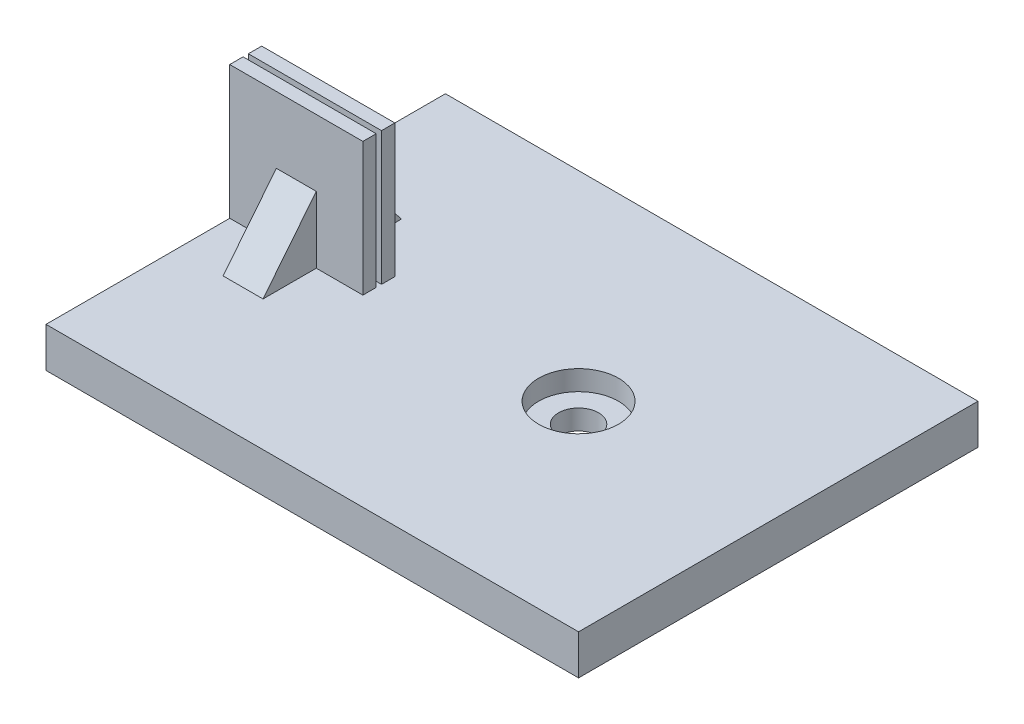
ISO-10303-21;
HEADER;
FILE_DESCRIPTION(('STEP AP214'),'2;1');
FILE_NAME('part.step','',(''),(''),'','','');
FILE_SCHEMA(('AUTOMOTIVE_DESIGN { 1 0 10303 214 1 1 1 1 }'));
ENDSEC;
DATA;
#1=APPLICATION_CONTEXT('core data for automotive mechanical design processes');
#2=APPLICATION_PROTOCOL_DEFINITION('international standard','automotive_design',2000,#1);
#3=PRODUCT_CONTEXT('',#1,'mechanical');
#4=PRODUCT('Part','Part','',(#3));
#5=PRODUCT_RELATED_PRODUCT_CATEGORY('part','',(#4));
#6=PRODUCT_DEFINITION_FORMATION('','',#4);
#7=PRODUCT_DEFINITION_CONTEXT('part definition',#1,'design');
#8=PRODUCT_DEFINITION('design','',#6,#7);
#9=PRODUCT_DEFINITION_SHAPE('','',#8);
#10=(LENGTH_UNIT() NAMED_UNIT(*) SI_UNIT(.MILLI.,.METRE.));
#11=(NAMED_UNIT(*) PLANE_ANGLE_UNIT() SI_UNIT($,.RADIAN.));
#12=(NAMED_UNIT(*) SI_UNIT($,.STERADIAN.) SOLID_ANGLE_UNIT());
#13=UNCERTAINTY_MEASURE_WITH_UNIT(LENGTH_MEASURE(1.E-05),#10,'distance_accuracy_value','');
#14=(GEOMETRIC_REPRESENTATION_CONTEXT(3) GLOBAL_UNCERTAINTY_ASSIGNED_CONTEXT((#13)) GLOBAL_UNIT_ASSIGNED_CONTEXT((#10,
#11,#12)) REPRESENTATION_CONTEXT('',''));
#15=CARTESIAN_POINT('',(0.,0.,0.));
#16=DIRECTION('',(0.,0.,1.));
#17=DIRECTION('',(1.,0.,0.));
#18=AXIS2_PLACEMENT_3D('',#15,#16,#17);
#19=CARTESIAN_POINT('',(0.,3.,0.));
#20=DIRECTION('',(0.,1.,0.));
#21=DIRECTION('',(0.,0.,1.));
#22=AXIS2_PLACEMENT_3D('',#19,#20,#21);
#23=PLANE('',#22);
#24=DIRECTION('',(0.,0.,-1.));
#25=VECTOR('',#24,1.);
#26=CARTESIAN_POINT('',(-18.5,3.,0.));
#27=LINE('',#26,#25);
#28=CARTESIAN_POINT('',(-18.5,3.,5.2));
#29=VERTEX_POINT('',#28);
#30=CARTESIAN_POINT('',(-18.5,3.,1.2));
#31=VERTEX_POINT('',#30);
#32=EDGE_CURVE('E193',#29,#31,#27,.T.);
#33=ORIENTED_EDGE('',*,*,#32,.F.);
#34=DIRECTION('',(1.,0.,0.));
#35=VECTOR('',#34,1.);
#36=CARTESIAN_POINT('',(0.,3.,5.2));
#37=LINE('',#36,#35);
#38=CARTESIAN_POINT('',(-21.5,3.,5.2));
#39=VERTEX_POINT('',#38);
#40=EDGE_CURVE('E200',#39,#29,#37,.T.);
#41=ORIENTED_EDGE('',*,*,#40,.F.);
#42=DIRECTION('',(0.,0.,-1.));
#43=VECTOR('',#42,1.);
#44=CARTESIAN_POINT('',(-21.5,3.,0.));
#45=LINE('',#44,#43);
#46=CARTESIAN_POINT('',(-21.5,3.,1.2));
#47=VERTEX_POINT('',#46);
#48=EDGE_CURVE('E187',#39,#47,#45,.T.);
#49=ORIENTED_EDGE('',*,*,#48,.T.);
#50=DIRECTION('',(1.,0.,0.));
#51=VECTOR('',#50,1.);
#52=CARTESIAN_POINT('',(-25.,3.,1.2));
#53=LINE('',#52,#51);
#54=CARTESIAN_POINT('',(-25.,3.,1.2));
#55=VERTEX_POINT('',#54);
#56=EDGE_CURVE('E242',#55,#47,#53,.T.);
#57=ORIENTED_EDGE('',*,*,#56,.F.);
#58=DIRECTION('',(0.,0.,1.));
#59=VECTOR('',#58,1.);
#60=CARTESIAN_POINT('',(-25.,3.,-15.));
#61=LINE('',#60,#59);
#62=CARTESIAN_POINT('',(-25.,3.,15.));
#63=VERTEX_POINT('',#62);
#64=EDGE_CURVE('E289',#55,#63,#61,.T.);
#65=ORIENTED_EDGE('',*,*,#64,.T.);
#66=DIRECTION('',(1.,0.,0.));
#67=VECTOR('',#66,1.);
#68=CARTESIAN_POINT('',(-25.,3.,15.));
#69=LINE('',#68,#67);
#70=CARTESIAN_POINT('',(15.,3.,15.));
#71=VERTEX_POINT('',#70);
#72=EDGE_CURVE('E287',#63,#71,#69,.T.);
#73=ORIENTED_EDGE('',*,*,#72,.T.);
#74=DIRECTION('',(0.,0.,-1.));
#75=VECTOR('',#74,1.);
#76=CARTESIAN_POINT('',(15.,3.,-15.));
#77=LINE('',#76,#75);
#78=CARTESIAN_POINT('',(15.,3.,-15.));
#79=VERTEX_POINT('',#78);
#80=EDGE_CURVE('E291',#71,#79,#77,.T.);
#81=ORIENTED_EDGE('',*,*,#80,.T.);
#82=DIRECTION('',(-1.,0.,0.));
#83=VECTOR('',#82,1.);
#84=CARTESIAN_POINT('',(-25.,3.,-15.));
#85=LINE('',#84,#83);
#86=CARTESIAN_POINT('',(-25.,3.,-15.));
#87=VERTEX_POINT('',#86);
#88=EDGE_CURVE('E293',#79,#87,#85,.T.);
#89=ORIENTED_EDGE('',*,*,#88,.T.);
#90=CARTESIAN_POINT('',(-25.,3.,-1.2));
#91=VERTEX_POINT('',#90);
#92=EDGE_CURVE('E284',#87,#91,#61,.T.);
#93=ORIENTED_EDGE('',*,*,#92,.T.);
#94=DIRECTION('',(-1.,0.,0.));
#95=VECTOR('',#94,1.);
#96=CARTESIAN_POINT('',(-25.,3.,-1.2));
#97=LINE('',#96,#95);
#98=CARTESIAN_POINT('',(-21.5,3.,-1.2));
#99=VERTEX_POINT('',#98);
#100=EDGE_CURVE('E219',#99,#91,#97,.T.);
#101=ORIENTED_EDGE('',*,*,#100,.F.);
#102=DIRECTION('',(0.,0.,-1.));
#103=VECTOR('',#102,1.);
#104=CARTESIAN_POINT('',(-21.5,3.,0.));
#105=LINE('',#104,#103);
#106=CARTESIAN_POINT('',(-21.5,3.,-5.2));
#107=VERTEX_POINT('',#106);
#108=EDGE_CURVE('E53',#99,#107,#105,.T.);
#109=ORIENTED_EDGE('',*,*,#108,.T.);
#110=DIRECTION('',(1.,0.,0.));
#111=VECTOR('',#110,1.);
#112=CARTESIAN_POINT('',(0.,3.,-5.2));
#113=LINE('',#112,#111);
#114=CARTESIAN_POINT('',(-18.5,3.,-5.2));
#115=VERTEX_POINT('',#114);
#116=EDGE_CURVE('E48',#115,#107,#113,.F.);
#117=ORIENTED_EDGE('',*,*,#116,.F.);
#118=DIRECTION('',(0.,0.,-1.));
#119=VECTOR('',#118,1.);
#120=CARTESIAN_POINT('',(-18.5,3.,0.));
#121=LINE('',#120,#119);
#122=CARTESIAN_POINT('',(-18.5,3.,-1.2));
#123=VERTEX_POINT('',#122);
#124=EDGE_CURVE('E177',#123,#115,#121,.T.);
#125=ORIENTED_EDGE('',*,*,#124,.F.);
#126=CARTESIAN_POINT('',(-15.,3.,-1.20000000000001));
#127=VERTEX_POINT('',#126);
#128=EDGE_CURVE('E208',#127,#123,#97,.T.);
#129=ORIENTED_EDGE('',*,*,#128,.F.);
#130=DIRECTION('',(0.,0.,-1.));
#131=VECTOR('',#130,1.);
#132=CARTESIAN_POINT('',(-15.,3.,-0.200000000000005));
#133=LINE('',#132,#131);
#134=CARTESIAN_POINT('',(-15.,3.,-0.200000000000005));
#135=VERTEX_POINT('',#134);
#136=EDGE_CURVE('E216',#135,#127,#133,.T.);
#137=ORIENTED_EDGE('',*,*,#136,.F.);
#138=DIRECTION('',(1.,0.,0.));
#139=VECTOR('',#138,1.);
#140=CARTESIAN_POINT('',(-25.,3.,-0.199999999999999));
#141=LINE('',#140,#139);
#142=CARTESIAN_POINT('',(-25.,3.,-0.199999999999999));
#143=VERTEX_POINT('',#142);
#144=EDGE_CURVE('E203',#143,#135,#141,.T.);
#145=ORIENTED_EDGE('',*,*,#144,.F.);
#146=CARTESIAN_POINT('',(-25.,3.,0.200000000000002));
#147=VERTEX_POINT('',#146);
#148=EDGE_CURVE('E288',#143,#147,#61,.T.);
#149=ORIENTED_EDGE('',*,*,#148,.T.);
#150=DIRECTION('',(-1.,0.,0.));
#151=VECTOR('',#150,1.);
#152=CARTESIAN_POINT('',(-25.,3.,0.200000000000002));
#153=LINE('',#152,#151);
#154=CARTESIAN_POINT('',(-15.,3.,0.200000000000002));
#155=VERTEX_POINT('',#154);
#156=EDGE_CURVE('E235',#155,#147,#153,.T.);
#157=ORIENTED_EDGE('',*,*,#156,.F.);
#158=DIRECTION('',(0.,0.,-1.));
#159=VECTOR('',#158,1.);
#160=CARTESIAN_POINT('',(-15.,3.,1.2));
#161=LINE('',#160,#159);
#162=CARTESIAN_POINT('',(-15.,3.,1.2));
#163=VERTEX_POINT('',#162);
#164=EDGE_CURVE('E244',#163,#155,#161,.T.);
#165=ORIENTED_EDGE('',*,*,#164,.F.);
#166=EDGE_CURVE('E230',#31,#163,#53,.T.);
#167=ORIENTED_EDGE('',*,*,#166,.F.);
#168=EDGE_LOOP('',(#33,#41,#49,#57,#65,#73,#81,#89,#93,#101,#109,#117,#125,#129,#137,#145,#149,
#157,#165,#167));
#169=FACE_BOUND('',#168,.T.);
#170=CARTESIAN_POINT('',(0.,3.,0.));
#171=DIRECTION('',(0.,1.,0.));
#172=DIRECTION('',(0.,0.,1.));
#173=AXIS2_PLACEMENT_3D('',#170,#171,#172);
#174=CIRCLE('',#173,3.);
#175=CARTESIAN_POINT('',(0.,3.,3.));
#176=VERTEX_POINT('',#175);
#177=EDGE_CURVE('E275',#176,#176,#174,.T.);
#178=ORIENTED_EDGE('',*,*,#177,.F.);
#179=EDGE_LOOP('',(#178));
#180=FACE_BOUND('',#179,.T.);
#181=ADVANCED_FACE('F33',(#169,#180),#23,.T.);
#182=CARTESIAN_POINT('',(0.,0.,0.));
#183=DIRECTION('',(0.,1.,0.));
#184=DIRECTION('',(0.,0.,1.));
#185=AXIS2_PLACEMENT_3D('',#182,#183,#184);
#186=PLANE('',#185);
#187=CARTESIAN_POINT('',(0.,0.,0.));
#188=DIRECTION('',(0.,1.,0.));
#189=DIRECTION('',(0.,0.,1.));
#190=AXIS2_PLACEMENT_3D('',#187,#188,#189);
#191=CIRCLE('',#190,1.5);
#192=CARTESIAN_POINT('',(0.,0.,1.5));
#193=VERTEX_POINT('',#192);
#194=EDGE_CURVE('E272',#193,#193,#191,.T.);
#195=ORIENTED_EDGE('',*,*,#194,.T.);
#196=EDGE_LOOP('',(#195));
#197=FACE_BOUND('',#196,.T.);
#198=CARTESIAN_POINT('',(0.,0.,0.));
#199=DIRECTION('',(0.,-1.,0.));
#200=DIRECTION('',(0.,0.,-1.));
#201=AXIS2_PLACEMENT_3D('',#198,#199,#200);
#202=CIRCLE('',#201,3.);
#203=CARTESIAN_POINT('',(0.,0.,-3.));
#204=VERTEX_POINT('',#203);
#205=EDGE_CURVE('E259',#204,#204,#202,.T.);
#206=ORIENTED_EDGE('',*,*,#205,.T.);
#207=EDGE_LOOP('',(#206));
#208=FACE_BOUND('',#207,.T.);
#209=ADVANCED_FACE('F379',(#197,#208),#186,.F.);
#210=CARTESIAN_POINT('',(-25.,3.,-15.));
#211=DIRECTION('',(1.,0.,0.));
#212=DIRECTION('',(0.,0.,-1.));
#213=AXIS2_PLACEMENT_3D('',#210,#211,#212);
#214=PLANE('',#213);
#215=DIRECTION('',(0.,0.,1.));
#216=VECTOR('',#215,1.);
#217=CARTESIAN_POINT('',(-25.,0.,-15.));
#218=LINE('',#217,#216);
#219=CARTESIAN_POINT('',(-25.,0.,-15.));
#220=VERTEX_POINT('',#219);
#221=CARTESIAN_POINT('',(-25.,0.,15.));
#222=VERTEX_POINT('',#221);
#223=EDGE_CURVE('E281',#220,#222,#218,.T.);
#224=ORIENTED_EDGE('',*,*,#223,.T.);
#225=DIRECTION('',(0.,-1.,0.));
#226=VECTOR('',#225,1.);
#227=CARTESIAN_POINT('',(-25.,3.,15.));
#228=LINE('',#227,#226);
#229=EDGE_CURVE('E41',#63,#222,#228,.T.);
#230=ORIENTED_EDGE('',*,*,#229,.F.);
#231=ORIENTED_EDGE('',*,*,#64,.F.);
#232=DIRECTION('',(0.,-1.,0.));
#233=VECTOR('',#232,1.);
#234=CARTESIAN_POINT('',(-25.,13.,1.2));
#235=LINE('',#234,#233);
#236=CARTESIAN_POINT('',(-25.,13.,1.2));
#237=VERTEX_POINT('',#236);
#238=EDGE_CURVE('E256',#237,#55,#235,.T.);
#239=ORIENTED_EDGE('',*,*,#238,.F.);
#240=DIRECTION('',(0.,0.,1.));
#241=VECTOR('',#240,1.);
#242=CARTESIAN_POINT('',(-25.,13.,1.2));
#243=LINE('',#242,#241);
#244=CARTESIAN_POINT('',(-25.,13.,0.200000000000002));
#245=VERTEX_POINT('',#244);
#246=EDGE_CURVE('E231',#245,#237,#243,.T.);
#247=ORIENTED_EDGE('',*,*,#246,.F.);
#248=DIRECTION('',(0.,-1.,0.));
#249=VECTOR('',#248,1.);
#250=CARTESIAN_POINT('',(-25.,13.,0.200000000000002));
#251=LINE('',#250,#249);
#252=EDGE_CURVE('E241',#245,#147,#251,.T.);
#253=ORIENTED_EDGE('',*,*,#252,.T.);
#254=ORIENTED_EDGE('',*,*,#148,.F.);
#255=DIRECTION('',(0.,-1.,0.));
#256=VECTOR('',#255,1.);
#257=CARTESIAN_POINT('',(-25.,13.,-0.199999999999999));
#258=LINE('',#257,#256);
#259=CARTESIAN_POINT('',(-25.,13.,-0.199999999999999));
#260=VERTEX_POINT('',#259);
#261=EDGE_CURVE('E228',#260,#143,#258,.T.);
#262=ORIENTED_EDGE('',*,*,#261,.F.);
#263=DIRECTION('',(0.,0.,1.));
#264=VECTOR('',#263,1.);
#265=CARTESIAN_POINT('',(-25.,13.,-0.199999999999999));
#266=LINE('',#265,#264);
#267=CARTESIAN_POINT('',(-25.,13.,-1.2));
#268=VERTEX_POINT('',#267);
#269=EDGE_CURVE('E204',#268,#260,#266,.T.);
#270=ORIENTED_EDGE('',*,*,#269,.F.);
#271=DIRECTION('',(0.,-1.,0.));
#272=VECTOR('',#271,1.);
#273=CARTESIAN_POINT('',(-25.,13.,-1.2));
#274=LINE('',#273,#272);
#275=EDGE_CURVE('E214',#268,#91,#274,.T.);
#276=ORIENTED_EDGE('',*,*,#275,.T.);
#277=ORIENTED_EDGE('',*,*,#92,.F.);
#278=DIRECTION('',(0.,-1.,0.));
#279=VECTOR('',#278,1.);
#280=CARTESIAN_POINT('',(-25.,3.,-15.));
#281=LINE('',#280,#279);
#282=EDGE_CURVE('E295',#87,#220,#281,.T.);
#283=ORIENTED_EDGE('',*,*,#282,.T.);
#284=EDGE_LOOP('',(#224,#230,#231,#239,#247,#253,#254,#262,#270,#276,#277,#283));
#285=FACE_BOUND('',#284,.T.);
#286=ADVANCED_FACE('F35',(#285),#214,.F.);
#287=CARTESIAN_POINT('',(-25.,3.,15.));
#288=DIRECTION('',(0.,0.,-1.));
#289=DIRECTION('',(-1.,0.,0.));
#290=AXIS2_PLACEMENT_3D('',#287,#288,#289);
#291=PLANE('',#290);
#292=DIRECTION('',(0.,-1.,0.));
#293=VECTOR('',#292,1.);
#294=CARTESIAN_POINT('',(15.,3.,15.));
#295=LINE('',#294,#293);
#296=CARTESIAN_POINT('',(15.,0.,15.));
#297=VERTEX_POINT('',#296);
#298=EDGE_CURVE('E309',#71,#297,#295,.T.);
#299=ORIENTED_EDGE('',*,*,#298,.F.);
#300=ORIENTED_EDGE('',*,*,#72,.F.);
#301=ORIENTED_EDGE('',*,*,#229,.T.);
#302=DIRECTION('',(1.,0.,0.));
#303=VECTOR('',#302,1.);
#304=CARTESIAN_POINT('',(-25.,0.,15.));
#305=LINE('',#304,#303);
#306=EDGE_CURVE('E298',#222,#297,#305,.T.);
#307=ORIENTED_EDGE('',*,*,#306,.T.);
#308=EDGE_LOOP('',(#299,#300,#301,#307));
#309=FACE_BOUND('',#308,.T.);
#310=ADVANCED_FACE('F316',(#309),#291,.F.);
#311=CARTESIAN_POINT('',(15.,3.,-15.));
#312=DIRECTION('',(-1.,0.,0.));
#313=DIRECTION('',(0.,0.,1.));
#314=AXIS2_PLACEMENT_3D('',#311,#312,#313);
#315=PLANE('',#314);
#316=DIRECTION('',(0.,0.,-1.));
#317=VECTOR('',#316,1.);
#318=CARTESIAN_POINT('',(15.,0.,-15.));
#319=LINE('',#318,#317);
#320=CARTESIAN_POINT('',(15.,0.,-15.));
#321=VERTEX_POINT('',#320);
#322=EDGE_CURVE('E300',#297,#321,#319,.T.);
#323=ORIENTED_EDGE('',*,*,#322,.T.);
#324=DIRECTION('',(0.,-1.,0.));
#325=VECTOR('',#324,1.);
#326=CARTESIAN_POINT('',(15.,3.,-15.));
#327=LINE('',#326,#325);
#328=EDGE_CURVE('E306',#79,#321,#327,.T.);
#329=ORIENTED_EDGE('',*,*,#328,.F.);
#330=ORIENTED_EDGE('',*,*,#80,.F.);
#331=ORIENTED_EDGE('',*,*,#298,.T.);
#332=EDGE_LOOP('',(#323,#329,#330,#331));
#333=FACE_BOUND('',#332,.T.);
#334=ADVANCED_FACE('F329',(#333),#315,.F.);
#335=CARTESIAN_POINT('',(-25.,3.,-15.));
#336=DIRECTION('',(0.,0.,1.));
#337=DIRECTION('',(1.,0.,0.));
#338=AXIS2_PLACEMENT_3D('',#335,#336,#337);
#339=PLANE('',#338);
#340=DIRECTION('',(-1.,0.,0.));
#341=VECTOR('',#340,1.);
#342=CARTESIAN_POINT('',(-25.,0.,-15.));
#343=LINE('',#342,#341);
#344=EDGE_CURVE('E302',#321,#220,#343,.T.);
#345=ORIENTED_EDGE('',*,*,#344,.T.);
#346=ORIENTED_EDGE('',*,*,#282,.F.);
#347=ORIENTED_EDGE('',*,*,#88,.F.);
#348=ORIENTED_EDGE('',*,*,#328,.T.);
#349=EDGE_LOOP('',(#345,#346,#347,#348));
#350=FACE_BOUND('',#349,.T.);
#351=ADVANCED_FACE('F333',(#350),#339,.F.);
#352=ORIENTED_EDGE('',*,*,#322,.F.);
#353=ORIENTED_EDGE('',*,*,#306,.F.);
#354=ORIENTED_EDGE('',*,*,#223,.F.);
#355=ORIENTED_EDGE('',*,*,#344,.F.);
#356=EDGE_LOOP('',(#352,#353,#354,#355));
#357=FACE_BOUND('',#356,.T.);
#358=CARTESIAN_POINT('',(0.,0.,0.));
#359=DIRECTION('',(0.,-1.,0.));
#360=DIRECTION('',(0.,0.,-1.));
#361=AXIS2_PLACEMENT_3D('',#358,#359,#360);
#362=CIRCLE('',#361,5.);
#363=CARTESIAN_POINT('',(0.,0.,-5.));
#364=VERTEX_POINT('',#363);
#365=EDGE_CURVE('E263',#364,#364,#362,.T.);
#366=ORIENTED_EDGE('',*,*,#365,.F.);
#367=EDGE_LOOP('',(#366));
#368=FACE_BOUND('',#367,.T.);
#369=ADVANCED_FACE('F325',(#357,#368),#186,.F.);
#370=CARTESIAN_POINT('',(0.,1.5,0.));
#371=DIRECTION('',(0.,1.,0.));
#372=DIRECTION('',(0.,0.,1.));
#373=AXIS2_PLACEMENT_3D('',#370,#371,#372);
#374=CYLINDRICAL_SURFACE('',#373,3.);
#375=CARTESIAN_POINT('',(0.,1.5,0.));
#376=DIRECTION('',(0.,1.,0.));
#377=DIRECTION('',(0.,0.,1.));
#378=AXIS2_PLACEMENT_3D('',#375,#376,#377);
#379=CIRCLE('',#378,3.);
#380=CARTESIAN_POINT('',(0.,1.5,3.));
#381=VERTEX_POINT('',#380);
#382=EDGE_CURVE('E278',#381,#381,#379,.T.);
#383=ORIENTED_EDGE('',*,*,#382,.F.);
#384=EDGE_LOOP('',(#383));
#385=FACE_BOUND('',#384,.T.);
#386=ORIENTED_EDGE('',*,*,#177,.T.);
#387=EDGE_LOOP('',(#386));
#388=FACE_BOUND('',#387,.T.);
#389=ADVANCED_FACE('F387',(#385,#388),#374,.F.);
#390=CARTESIAN_POINT('',(0.,1.5,0.));
#391=DIRECTION('',(0.,1.,0.));
#392=DIRECTION('',(0.,0.,1.));
#393=AXIS2_PLACEMENT_3D('',#390,#391,#392);
#394=PLANE('',#393);
#395=CARTESIAN_POINT('',(0.,1.5,0.));
#396=DIRECTION('',(0.,1.,0.));
#397=DIRECTION('',(0.,0.,1.));
#398=AXIS2_PLACEMENT_3D('',#395,#396,#397);
#399=CIRCLE('',#398,1.5);
#400=CARTESIAN_POINT('',(0.,1.5,1.5));
#401=VERTEX_POINT('',#400);
#402=EDGE_CURVE('E269',#401,#401,#399,.T.);
#403=ORIENTED_EDGE('',*,*,#402,.F.);
#404=EDGE_LOOP('',(#403));
#405=FACE_BOUND('',#404,.T.);
#406=ORIENTED_EDGE('',*,*,#382,.T.);
#407=EDGE_LOOP('',(#406));
#408=FACE_BOUND('',#407,.T.);
#409=ADVANCED_FACE('F582',(#405,#408),#394,.T.);
#410=CARTESIAN_POINT('',(0.,0.,0.));
#411=DIRECTION('',(0.,1.,0.));
#412=DIRECTION('',(0.,0.,1.));
#413=AXIS2_PLACEMENT_3D('',#410,#411,#412);
#414=CYLINDRICAL_SURFACE('',#413,1.5);
#415=ORIENTED_EDGE('',*,*,#194,.F.);
#416=EDGE_LOOP('',(#415));
#417=FACE_BOUND('',#416,.T.);
#418=ORIENTED_EDGE('',*,*,#402,.T.);
#419=EDGE_LOOP('',(#418));
#420=FACE_BOUND('',#419,.T.);
#421=ADVANCED_FACE('F414',(#417,#420),#414,.F.);
#422=CARTESIAN_POINT('',(0.,0.5,0.));
#423=DIRECTION('',(0.,-1.,0.));
#424=DIRECTION('',(0.,0.,-1.));
#425=AXIS2_PLACEMENT_3D('',#422,#423,#424);
#426=CYLINDRICAL_SURFACE('',#425,5.);
#427=CARTESIAN_POINT('',(0.,0.5,0.));
#428=DIRECTION('',(0.,-1.,0.));
#429=DIRECTION('',(0.,0.,-1.));
#430=AXIS2_PLACEMENT_3D('',#427,#428,#429);
#431=CIRCLE('',#430,5.);
#432=CARTESIAN_POINT('',(0.,0.5,-5.));
#433=VERTEX_POINT('',#432);
#434=EDGE_CURVE('E266',#433,#433,#431,.T.);
#435=ORIENTED_EDGE('',*,*,#434,.F.);
#436=EDGE_LOOP('',(#435));
#437=FACE_BOUND('',#436,.T.);
#438=ORIENTED_EDGE('',*,*,#365,.T.);
#439=EDGE_LOOP('',(#438));
#440=FACE_BOUND('',#439,.T.);
#441=ADVANCED_FACE('F418',(#437,#440),#426,.F.);
#442=CARTESIAN_POINT('',(0.,0.5,0.));
#443=DIRECTION('',(0.,-1.,0.));
#444=DIRECTION('',(0.,0.,-1.));
#445=AXIS2_PLACEMENT_3D('',#442,#443,#444);
#446=PLANE('',#445);
#447=CARTESIAN_POINT('',(0.,0.5,0.));
#448=DIRECTION('',(0.,-1.,0.));
#449=DIRECTION('',(0.,0.,-1.));
#450=AXIS2_PLACEMENT_3D('',#447,#448,#449);
#451=CIRCLE('',#450,3.);
#452=CARTESIAN_POINT('',(0.,0.5,-3.));
#453=VERTEX_POINT('',#452);
#454=EDGE_CURVE('E260',#453,#453,#451,.T.);
#455=ORIENTED_EDGE('',*,*,#454,.F.);
#456=EDGE_LOOP('',(#455));
#457=FACE_BOUND('',#456,.T.);
#458=ORIENTED_EDGE('',*,*,#434,.T.);
#459=EDGE_LOOP('',(#458));
#460=FACE_BOUND('',#459,.T.);
#461=ADVANCED_FACE('F422',(#457,#460),#446,.T.);
#462=CARTESIAN_POINT('',(0.,0.5,0.));
#463=DIRECTION('',(0.,-1.,0.));
#464=DIRECTION('',(0.,0.,-1.));
#465=AXIS2_PLACEMENT_3D('',#462,#463,#464);
#466=CYLINDRICAL_SURFACE('',#465,3.);
#467=ORIENTED_EDGE('',*,*,#454,.T.);
#468=EDGE_LOOP('',(#467));
#469=FACE_BOUND('',#468,.T.);
#470=ORIENTED_EDGE('',*,*,#205,.F.);
#471=EDGE_LOOP('',(#470));
#472=FACE_BOUND('',#471,.T.);
#473=ADVANCED_FACE('F431',(#469,#472),#466,.T.);
#474=CARTESIAN_POINT('',(-25.,13.,1.2));
#475=DIRECTION('',(0.,0.,-1.));
#476=DIRECTION('',(-1.,0.,0.));
#477=AXIS2_PLACEMENT_3D('',#474,#475,#476);
#478=PLANE('',#477);
#479=DIRECTION('',(1.,0.,0.));
#480=VECTOR('',#479,1.);
#481=CARTESIAN_POINT('',(-25.,8.,1.2));
#482=LINE('',#481,#480);
#483=CARTESIAN_POINT('',(-21.5,8.,1.2));
#484=VERTEX_POINT('',#483);
#485=CARTESIAN_POINT('',(-18.5,8.,1.2));
#486=VERTEX_POINT('',#485);
#487=EDGE_CURVE('E196',#484,#486,#482,.T.);
#488=ORIENTED_EDGE('',*,*,#487,.T.);
#489=DIRECTION('',(0.,-1.,0.));
#490=VECTOR('',#489,1.);
#491=CARTESIAN_POINT('',(-18.5,13.,1.2));
#492=LINE('',#491,#490);
#493=EDGE_CURVE('E190',#486,#31,#492,.T.);
#494=ORIENTED_EDGE('',*,*,#493,.T.);
#495=ORIENTED_EDGE('',*,*,#166,.T.);
#496=DIRECTION('',(0.,-1.,0.));
#497=VECTOR('',#496,1.);
#498=CARTESIAN_POINT('',(-15.,13.,1.2));
#499=LINE('',#498,#497);
#500=CARTESIAN_POINT('',(-15.,13.,1.2));
#501=VERTEX_POINT('',#500);
#502=EDGE_CURVE('E253',#501,#163,#499,.T.);
#503=ORIENTED_EDGE('',*,*,#502,.F.);
#504=DIRECTION('',(1.,0.,0.));
#505=VECTOR('',#504,1.);
#506=CARTESIAN_POINT('',(-25.,13.,1.2));
#507=LINE('',#506,#505);
#508=EDGE_CURVE('E234',#237,#501,#507,.T.);
#509=ORIENTED_EDGE('',*,*,#508,.F.);
#510=ORIENTED_EDGE('',*,*,#238,.T.);
#511=ORIENTED_EDGE('',*,*,#56,.T.);
#512=DIRECTION('',(0.,-1.,0.));
#513=VECTOR('',#512,1.);
#514=CARTESIAN_POINT('',(-21.5,13.,1.2));
#515=LINE('',#514,#513);
#516=EDGE_CURVE('E184',#484,#47,#515,.T.);
#517=ORIENTED_EDGE('',*,*,#516,.F.);
#518=EDGE_LOOP('',(#488,#494,#495,#503,#509,#510,#511,#517));
#519=FACE_BOUND('',#518,.T.);
#520=ADVANCED_FACE('F364',(#519),#478,.F.);
#521=CARTESIAN_POINT('',(-15.,13.,1.2));
#522=DIRECTION('',(-1.,0.,0.));
#523=DIRECTION('',(0.,0.,1.));
#524=AXIS2_PLACEMENT_3D('',#521,#522,#523);
#525=PLANE('',#524);
#526=ORIENTED_EDGE('',*,*,#164,.T.);
#527=DIRECTION('',(0.,-1.,0.));
#528=VECTOR('',#527,1.);
#529=CARTESIAN_POINT('',(-15.,13.,0.200000000000002));
#530=LINE('',#529,#528);
#531=CARTESIAN_POINT('',(-15.,13.,0.200000000000002));
#532=VERTEX_POINT('',#531);
#533=EDGE_CURVE('E250',#532,#155,#530,.T.);
#534=ORIENTED_EDGE('',*,*,#533,.F.);
#535=DIRECTION('',(0.,0.,-1.));
#536=VECTOR('',#535,1.);
#537=CARTESIAN_POINT('',(-15.,13.,1.2));
#538=LINE('',#537,#536);
#539=EDGE_CURVE('E237',#501,#532,#538,.T.);
#540=ORIENTED_EDGE('',*,*,#539,.F.);
#541=ORIENTED_EDGE('',*,*,#502,.T.);
#542=EDGE_LOOP('',(#526,#534,#540,#541));
#543=FACE_BOUND('',#542,.T.);
#544=ADVANCED_FACE('F350',(#543),#525,.F.);
#545=CARTESIAN_POINT('',(-25.,13.,0.200000000000002));
#546=DIRECTION('',(0.,0.,1.));
#547=DIRECTION('',(1.,0.,0.));
#548=AXIS2_PLACEMENT_3D('',#545,#546,#547);
#549=PLANE('',#548);
#550=ORIENTED_EDGE('',*,*,#156,.T.);
#551=ORIENTED_EDGE('',*,*,#252,.F.);
#552=DIRECTION('',(-1.,0.,0.));
#553=VECTOR('',#552,1.);
#554=CARTESIAN_POINT('',(-25.,13.,0.200000000000002));
#555=LINE('',#554,#553);
#556=EDGE_CURVE('E239',#532,#245,#555,.T.);
#557=ORIENTED_EDGE('',*,*,#556,.F.);
#558=ORIENTED_EDGE('',*,*,#533,.T.);
#559=EDGE_LOOP('',(#550,#551,#557,#558));
#560=FACE_BOUND('',#559,.T.);
#561=ADVANCED_FACE('F346',(#560),#549,.F.);
#562=CARTESIAN_POINT('',(0.,13.,0.));
#563=DIRECTION('',(0.,-1.,0.));
#564=DIRECTION('',(0.,0.,-1.));
#565=AXIS2_PLACEMENT_3D('',#562,#563,#564);
#566=PLANE('',#565);
#567=ORIENTED_EDGE('',*,*,#246,.T.);
#568=ORIENTED_EDGE('',*,*,#508,.T.);
#569=ORIENTED_EDGE('',*,*,#539,.T.);
#570=ORIENTED_EDGE('',*,*,#556,.T.);
#571=EDGE_LOOP('',(#567,#568,#569,#570));
#572=FACE_BOUND('',#571,.T.);
#573=ADVANCED_FACE('F366',(#572),#566,.F.);
#574=CARTESIAN_POINT('',(-25.,13.,-0.199999999999999));
#575=DIRECTION('',(0.,0.,-1.));
#576=DIRECTION('',(-1.,0.,0.));
#577=AXIS2_PLACEMENT_3D('',#574,#575,#576);
#578=PLANE('',#577);
#579=ORIENTED_EDGE('',*,*,#144,.T.);
#580=DIRECTION('',(0.,-1.,0.));
#581=VECTOR('',#580,1.);
#582=CARTESIAN_POINT('',(-15.,13.,-0.200000000000005));
#583=LINE('',#582,#581);
#584=CARTESIAN_POINT('',(-15.,13.,-0.200000000000005));
#585=VERTEX_POINT('',#584);
#586=EDGE_CURVE('E225',#585,#135,#583,.T.);
#587=ORIENTED_EDGE('',*,*,#586,.F.);
#588=DIRECTION('',(1.,0.,0.));
#589=VECTOR('',#588,1.);
#590=CARTESIAN_POINT('',(-25.,13.,-0.199999999999999));
#591=LINE('',#590,#589);
#592=EDGE_CURVE('E207',#260,#585,#591,.T.);
#593=ORIENTED_EDGE('',*,*,#592,.F.);
#594=ORIENTED_EDGE('',*,*,#261,.T.);
#595=EDGE_LOOP('',(#579,#587,#593,#594));
#596=FACE_BOUND('',#595,.T.);
#597=ADVANCED_FACE('F368',(#596),#578,.F.);
#598=CARTESIAN_POINT('',(-15.,13.,-0.200000000000005));
#599=DIRECTION('',(-1.,0.,0.));
#600=DIRECTION('',(0.,0.,1.));
#601=AXIS2_PLACEMENT_3D('',#598,#599,#600);
#602=PLANE('',#601);
#603=ORIENTED_EDGE('',*,*,#136,.T.);
#604=DIRECTION('',(0.,-1.,0.));
#605=VECTOR('',#604,1.);
#606=CARTESIAN_POINT('',(-15.,13.,-1.20000000000001));
#607=LINE('',#606,#605);
#608=CARTESIAN_POINT('',(-15.,13.,-1.20000000000001));
#609=VERTEX_POINT('',#608);
#610=EDGE_CURVE('E223',#609,#127,#607,.T.);
#611=ORIENTED_EDGE('',*,*,#610,.F.);
#612=DIRECTION('',(0.,0.,-1.));
#613=VECTOR('',#612,1.);
#614=CARTESIAN_POINT('',(-15.,13.,-0.200000000000005));
#615=LINE('',#614,#613);
#616=EDGE_CURVE('E210',#585,#609,#615,.T.);
#617=ORIENTED_EDGE('',*,*,#616,.F.);
#618=ORIENTED_EDGE('',*,*,#586,.T.);
#619=EDGE_LOOP('',(#603,#611,#617,#618));
#620=FACE_BOUND('',#619,.T.);
#621=ADVANCED_FACE('F374',(#620),#602,.F.);
#622=CARTESIAN_POINT('',(-25.,13.,-1.2));
#623=DIRECTION('',(0.,0.,1.));
#624=DIRECTION('',(1.,0.,0.));
#625=AXIS2_PLACEMENT_3D('',#622,#623,#624);
#626=PLANE('',#625);
#627=ORIENTED_EDGE('',*,*,#128,.T.);
#628=DIRECTION('',(0.,1.,0.));
#629=VECTOR('',#628,1.);
#630=CARTESIAN_POINT('',(-18.5,13.,-1.2));
#631=LINE('',#630,#629);
#632=CARTESIAN_POINT('',(-18.5,8.,-1.2));
#633=VERTEX_POINT('',#632);
#634=EDGE_CURVE('E160',#123,#633,#631,.T.);
#635=ORIENTED_EDGE('',*,*,#634,.T.);
#636=DIRECTION('',(1.,0.,0.));
#637=VECTOR('',#636,1.);
#638=CARTESIAN_POINT('',(-25.,8.,-1.2));
#639=LINE('',#638,#637);
#640=CARTESIAN_POINT('',(-21.5,8.,-1.2));
#641=VERTEX_POINT('',#640);
#642=EDGE_CURVE('E11',#633,#641,#639,.F.);
#643=ORIENTED_EDGE('',*,*,#642,.T.);
#644=DIRECTION('',(0.,1.,0.));
#645=VECTOR('',#644,1.);
#646=CARTESIAN_POINT('',(-21.5,13.,-1.2));
#647=LINE('',#646,#645);
#648=EDGE_CURVE('E158',#99,#641,#647,.T.);
#649=ORIENTED_EDGE('',*,*,#648,.F.);
#650=ORIENTED_EDGE('',*,*,#100,.T.);
#651=ORIENTED_EDGE('',*,*,#275,.F.);
#652=DIRECTION('',(-1.,0.,0.));
#653=VECTOR('',#652,1.);
#654=CARTESIAN_POINT('',(-25.,13.,-1.2));
#655=LINE('',#654,#653);
#656=EDGE_CURVE('E212',#609,#268,#655,.T.);
#657=ORIENTED_EDGE('',*,*,#656,.F.);
#658=ORIENTED_EDGE('',*,*,#610,.T.);
#659=EDGE_LOOP('',(#627,#635,#643,#649,#650,#651,#657,#658));
#660=FACE_BOUND('',#659,.T.);
#661=ADVANCED_FACE('F157',(#660),#626,.F.);
#662=CARTESIAN_POINT('',(0.,13.,0.));
#663=DIRECTION('',(0.,-1.,0.));
#664=DIRECTION('',(0.,0.,-1.));
#665=AXIS2_PLACEMENT_3D('',#662,#663,#664);
#666=PLANE('',#665);
#667=ORIENTED_EDGE('',*,*,#269,.T.);
#668=ORIENTED_EDGE('',*,*,#592,.T.);
#669=ORIENTED_EDGE('',*,*,#616,.T.);
#670=ORIENTED_EDGE('',*,*,#656,.T.);
#671=EDGE_LOOP('',(#667,#668,#669,#670));
#672=FACE_BOUND('',#671,.T.);
#673=ADVANCED_FACE('F478',(#672),#666,.F.);
#674=CARTESIAN_POINT('',(-20.,8.,1.2));
#675=DIRECTION('',(0.,0.624695047554424,0.78086880944303));
#676=DIRECTION('',(0.,-0.78086880944303,0.624695047554424));
#677=AXIS2_PLACEMENT_3D('',#674,#675,#676);
#678=PLANE('',#677);
#679=DIRECTION('',(0.,-0.78086880944303,0.624695047554424));
#680=VECTOR('',#679,1.);
#681=CARTESIAN_POINT('',(-21.5,8.,1.2));
#682=LINE('',#681,#680);
#683=EDGE_CURVE('E180',#484,#39,#682,.T.);
#684=ORIENTED_EDGE('',*,*,#683,.T.);
#685=ORIENTED_EDGE('',*,*,#40,.T.);
#686=DIRECTION('',(0.,-0.78086880944303,0.624695047554424));
#687=VECTOR('',#686,1.);
#688=CARTESIAN_POINT('',(-18.5,8.,1.2));
#689=LINE('',#688,#687);
#690=EDGE_CURVE('E181',#486,#29,#689,.T.);
#691=ORIENTED_EDGE('',*,*,#690,.F.);
#692=ORIENTED_EDGE('',*,*,#487,.F.);
#693=EDGE_LOOP('',(#684,#685,#691,#692));
#694=FACE_BOUND('',#693,.T.);
#695=ADVANCED_FACE('F359',(#694),#678,.T.);
#696=CARTESIAN_POINT('',(-18.5,6.5,0.));
#697=DIRECTION('',(1.,0.,0.));
#698=DIRECTION('',(0.,0.,-1.));
#699=AXIS2_PLACEMENT_3D('',#696,#697,#698);
#700=PLANE('',#699);
#701=ORIENTED_EDGE('',*,*,#493,.F.);
#702=ORIENTED_EDGE('',*,*,#690,.T.);
#703=ORIENTED_EDGE('',*,*,#32,.T.);
#704=EDGE_LOOP('',(#701,#702,#703));
#705=FACE_BOUND('',#704,.T.);
#706=ADVANCED_FACE('F355',(#705),#700,.T.);
#707=CARTESIAN_POINT('',(-21.5,6.5,0.));
#708=DIRECTION('',(1.,0.,0.));
#709=DIRECTION('',(0.,0.,-1.));
#710=AXIS2_PLACEMENT_3D('',#707,#708,#709);
#711=PLANE('',#710);
#712=ORIENTED_EDGE('',*,*,#48,.F.);
#713=ORIENTED_EDGE('',*,*,#683,.F.);
#714=ORIENTED_EDGE('',*,*,#516,.T.);
#715=EDGE_LOOP('',(#712,#713,#714));
#716=FACE_BOUND('',#715,.T.);
#717=ADVANCED_FACE('F363',(#716),#711,.F.);
#718=CARTESIAN_POINT('',(-20.,8.,-1.2));
#719=DIRECTION('',(0.,-0.624695047554424,0.78086880944303));
#720=DIRECTION('',(0.,-0.78086880944303,-0.624695047554424));
#721=AXIS2_PLACEMENT_3D('',#718,#719,#720);
#722=PLANE('',#721);
#723=DIRECTION('',(0.,-0.78086880944303,-0.624695047554424));
#724=VECTOR('',#723,1.);
#725=CARTESIAN_POINT('',(-18.5,8.,-1.2));
#726=LINE('',#725,#724);
#727=EDGE_CURVE('E169',#633,#115,#726,.T.);
#728=ORIENTED_EDGE('',*,*,#727,.T.);
#729=ORIENTED_EDGE('',*,*,#116,.T.);
#730=DIRECTION('',(0.,-0.78086880944303,-0.624695047554424));
#731=VECTOR('',#730,1.);
#732=CARTESIAN_POINT('',(-21.5,8.,-1.2));
#733=LINE('',#732,#731);
#734=EDGE_CURVE('E168',#641,#107,#733,.T.);
#735=ORIENTED_EDGE('',*,*,#734,.F.);
#736=ORIENTED_EDGE('',*,*,#642,.F.);
#737=EDGE_LOOP('',(#728,#729,#735,#736));
#738=FACE_BOUND('',#737,.T.);
#739=ADVANCED_FACE('F171',(#738),#722,.F.);
#740=CARTESIAN_POINT('',(-21.5,6.5,0.));
#741=DIRECTION('',(1.,0.,0.));
#742=DIRECTION('',(0.,0.,-1.));
#743=AXIS2_PLACEMENT_3D('',#740,#741,#742);
#744=PLANE('',#743);
#745=ORIENTED_EDGE('',*,*,#108,.F.);
#746=ORIENTED_EDGE('',*,*,#648,.T.);
#747=ORIENTED_EDGE('',*,*,#734,.T.);
#748=EDGE_LOOP('',(#745,#746,#747));
#749=FACE_BOUND('',#748,.T.);
#750=ADVANCED_FACE('F167',(#749),#744,.F.);
#751=CARTESIAN_POINT('',(-18.5,6.5,0.));
#752=DIRECTION('',(1.,0.,0.));
#753=DIRECTION('',(0.,0.,-1.));
#754=AXIS2_PLACEMENT_3D('',#751,#752,#753);
#755=PLANE('',#754);
#756=ORIENTED_EDGE('',*,*,#727,.F.);
#757=ORIENTED_EDGE('',*,*,#634,.F.);
#758=ORIENTED_EDGE('',*,*,#124,.T.);
#759=EDGE_LOOP('',(#756,#757,#758));
#760=FACE_BOUND('',#759,.T.);
#761=ADVANCED_FACE('F499',(#760),#755,.T.);
#762=CLOSED_SHELL('',(#181,#209,#286,#310,#334,#351,#369,#389,#409,#421,#441,#461,#473,#520,
#544,#561,#573,#597,#621,#661,#673,#695,#706,#717,#739,#750,#761));
#763=MANIFOLD_SOLID_BREP('B2',#762);
#764=ADVANCED_BREP_SHAPE_REPRESENTATION('',(#18,#763),#14);
#765=SHAPE_DEFINITION_REPRESENTATION(#9,#764);
ENDSEC;
END-ISO-10303-21;
